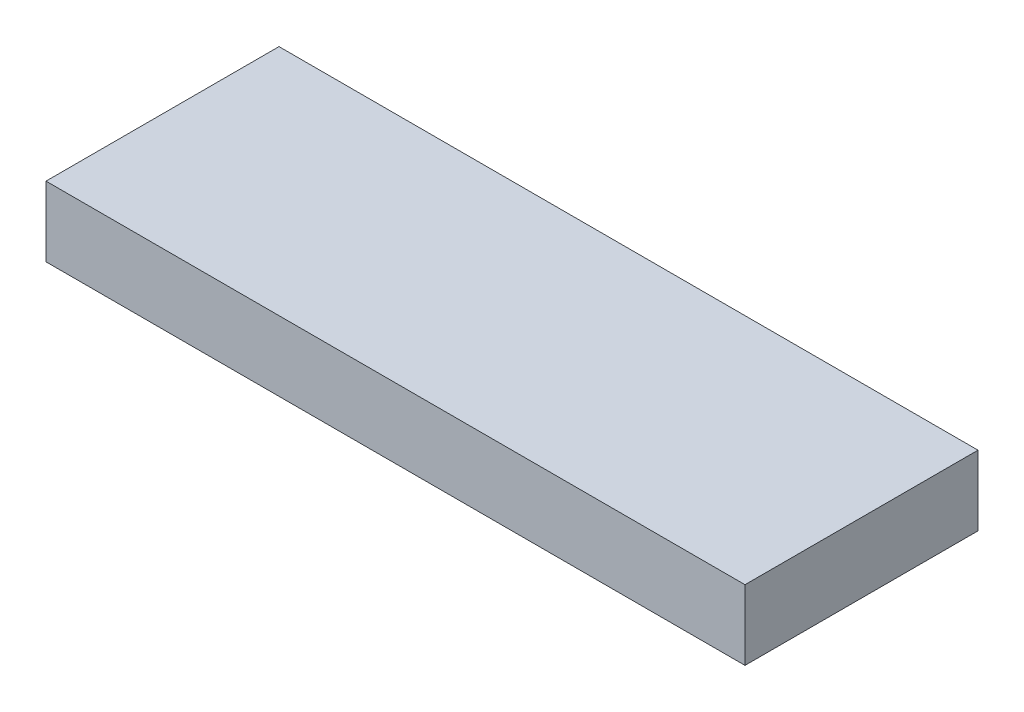
ISO-10303-21;
HEADER;
FILE_DESCRIPTION(('STEP AP214'),'2;1');
FILE_NAME('part.step','',(''),(''),'','','');
FILE_SCHEMA(('AUTOMOTIVE_DESIGN { 1 0 10303 214 1 1 1 1 }'));
ENDSEC;
DATA;
#1=APPLICATION_CONTEXT('core data for automotive mechanical design processes');
#2=APPLICATION_PROTOCOL_DEFINITION('international standard','automotive_design',2000,#1);
#3=PRODUCT_CONTEXT('',#1,'mechanical');
#4=PRODUCT('Part','Part','',(#3));
#5=PRODUCT_RELATED_PRODUCT_CATEGORY('part','',(#4));
#6=PRODUCT_DEFINITION_FORMATION('','',#4);
#7=PRODUCT_DEFINITION_CONTEXT('part definition',#1,'design');
#8=PRODUCT_DEFINITION('design','',#6,#7);
#9=PRODUCT_DEFINITION_SHAPE('','',#8);
#10=(LENGTH_UNIT() NAMED_UNIT(*) SI_UNIT(.MILLI.,.METRE.));
#11=(NAMED_UNIT(*) PLANE_ANGLE_UNIT() SI_UNIT($,.RADIAN.));
#12=(NAMED_UNIT(*) SI_UNIT($,.STERADIAN.) SOLID_ANGLE_UNIT());
#13=UNCERTAINTY_MEASURE_WITH_UNIT(LENGTH_MEASURE(1.E-05),#10,'distance_accuracy_value','');
#14=(GEOMETRIC_REPRESENTATION_CONTEXT(3) GLOBAL_UNCERTAINTY_ASSIGNED_CONTEXT((#13)) GLOBAL_UNIT_ASSIGNED_CONTEXT((#10,
#11,#12)) REPRESENTATION_CONTEXT('',''));
#15=CARTESIAN_POINT('',(0.,0.,0.));
#16=DIRECTION('',(0.,0.,1.));
#17=DIRECTION('',(1.,0.,0.));
#18=AXIS2_PLACEMENT_3D('',#15,#16,#17);
#19=CARTESIAN_POINT('',(300.,46.99,13.));
#20=DIRECTION('',(0.,0.,-1.));
#21=DIRECTION('',(-1.,0.,0.));
#22=AXIS2_PLACEMENT_3D('',#19,#20,#21);
#23=PLANE('',#22);
#24=DIRECTION('',(0.,-1.,0.));
#25=VECTOR('',#24,1.);
#26=CARTESIAN_POINT('',(300.,1.71683972880179E-13,13.));
#27=LINE('',#26,#25);
#28=CARTESIAN_POINT('',(300.,50.,13.));
#29=VERTEX_POINT('',#28);
#30=CARTESIAN_POINT('',(300.,47.,13.));
#31=VERTEX_POINT('',#30);
#32=EDGE_CURVE('E81',#29,#31,#27,.T.);
#33=ORIENTED_EDGE('',*,*,#32,.T.);
#34=DIRECTION('',(-1.,0.,0.));
#35=VECTOR('',#34,1.);
#36=CARTESIAN_POINT('',(300.,47.,13.));
#37=LINE('',#36,#35);
#38=CARTESIAN_POINT('',(270.,47.,13.));
#39=VERTEX_POINT('',#38);
#40=EDGE_CURVE('E85',#31,#39,#37,.T.);
#41=ORIENTED_EDGE('',*,*,#40,.T.);
#42=DIRECTION('',(0.,1.,0.));
#43=VECTOR('',#42,1.);
#44=CARTESIAN_POINT('',(270.,46.99,13.));
#45=LINE('',#44,#43);
#46=CARTESIAN_POINT('',(270.,50.,13.));
#47=VERTEX_POINT('',#46);
#48=EDGE_CURVE('E44',#39,#47,#45,.T.);
#49=ORIENTED_EDGE('',*,*,#48,.T.);
#50=DIRECTION('',(1.,0.,0.));
#51=VECTOR('',#50,1.);
#52=CARTESIAN_POINT('',(-300.,50.,13.));
#53=LINE('',#52,#51);
#54=EDGE_CURVE('E99',#47,#29,#53,.T.);
#55=ORIENTED_EDGE('',*,*,#54,.T.);
#56=EDGE_LOOP('',(#33,#41,#49,#55));
#57=FACE_BOUND('',#56,.T.);
#58=ADVANCED_FACE('F35',(#57),#23,.T.);
#59=CARTESIAN_POINT('',(300.,46.99,23.));
#60=DIRECTION('',(0.,0.,1.));
#61=DIRECTION('',(1.,0.,0.));
#62=AXIS2_PLACEMENT_3D('',#59,#60,#61);
#63=PLANE('',#62);
#64=DIRECTION('',(0.,1.,0.));
#65=VECTOR('',#64,1.);
#66=CARTESIAN_POINT('',(270.,46.99,23.));
#67=LINE('',#66,#65);
#68=CARTESIAN_POINT('',(270.,47.,23.));
#69=VERTEX_POINT('',#68);
#70=CARTESIAN_POINT('',(270.,50.,23.));
#71=VERTEX_POINT('',#70);
#72=EDGE_CURVE('E11',#69,#71,#67,.T.);
#73=ORIENTED_EDGE('',*,*,#72,.F.);
#74=DIRECTION('',(1.,0.,0.));
#75=VECTOR('',#74,1.);
#76=CARTESIAN_POINT('',(300.,47.,23.));
#77=LINE('',#76,#75);
#78=CARTESIAN_POINT('',(300.,47.,23.));
#79=VERTEX_POINT('',#78);
#80=EDGE_CURVE('E96',#69,#79,#77,.T.);
#81=ORIENTED_EDGE('',*,*,#80,.T.);
#82=DIRECTION('',(0.,1.,0.));
#83=VECTOR('',#82,1.);
#84=CARTESIAN_POINT('',(300.,1.71683972880179E-13,23.));
#85=LINE('',#84,#83);
#86=CARTESIAN_POINT('',(300.,50.,23.));
#87=VERTEX_POINT('',#86);
#88=EDGE_CURVE('E39',#79,#87,#85,.T.);
#89=ORIENTED_EDGE('',*,*,#88,.T.);
#90=DIRECTION('',(-1.,0.,0.));
#91=VECTOR('',#90,1.);
#92=CARTESIAN_POINT('',(-300.,50.,23.));
#93=LINE('',#92,#91);
#94=EDGE_CURVE('E88',#87,#71,#93,.T.);
#95=ORIENTED_EDGE('',*,*,#94,.T.);
#96=EDGE_LOOP('',(#73,#81,#89,#95));
#97=FACE_BOUND('',#96,.T.);
#98=ADVANCED_FACE('F94',(#97),#63,.T.);
#99=CARTESIAN_POINT('',(270.,46.99,13.));
#100=DIRECTION('',(-1.,0.,0.));
#101=DIRECTION('',(0.,0.,1.));
#102=AXIS2_PLACEMENT_3D('',#99,#100,#101);
#103=PLANE('',#102);
#104=ORIENTED_EDGE('',*,*,#48,.F.);
#105=DIRECTION('',(0.,0.,1.));
#106=VECTOR('',#105,1.);
#107=CARTESIAN_POINT('',(270.,47.,3.));
#108=LINE('',#107,#106);
#109=EDGE_CURVE('E102',#39,#69,#108,.T.);
#110=ORIENTED_EDGE('',*,*,#109,.T.);
#111=ORIENTED_EDGE('',*,*,#72,.T.);
#112=DIRECTION('',(0.,0.,-1.));
#113=VECTOR('',#112,1.);
#114=CARTESIAN_POINT('',(270.,50.,60.));
#115=LINE('',#114,#113);
#116=EDGE_CURVE('E90',#71,#47,#115,.T.);
#117=ORIENTED_EDGE('',*,*,#116,.T.);
#118=EDGE_LOOP('',(#104,#110,#111,#117));
#119=FACE_BOUND('',#118,.T.);
#120=ADVANCED_FACE('F111',(#119),#103,.T.);
#121=CARTESIAN_POINT('',(300.,1.71683972880179E-13,0.));
#122=DIRECTION('',(-1.,0.,0.));
#123=DIRECTION('',(0.,-1.,0.));
#124=AXIS2_PLACEMENT_3D('',#121,#122,#123);
#125=PLANE('',#124);
#126=ORIENTED_EDGE('',*,*,#32,.F.);
#127=DIRECTION('',(0.,0.,-1.));
#128=VECTOR('',#127,1.);
#129=CARTESIAN_POINT('',(300.,50.,60.));
#130=LINE('',#129,#128);
#131=EDGE_CURVE('E76',#87,#29,#130,.T.);
#132=ORIENTED_EDGE('',*,*,#131,.F.);
#133=ORIENTED_EDGE('',*,*,#88,.F.);
#134=DIRECTION('',(0.,0.,1.));
#135=VECTOR('',#134,1.);
#136=CARTESIAN_POINT('',(300.,47.,3.));
#137=LINE('',#136,#135);
#138=EDGE_CURVE('E84',#31,#79,#137,.T.);
#139=ORIENTED_EDGE('',*,*,#138,.F.);
#140=EDGE_LOOP('',(#126,#132,#133,#139));
#141=FACE_BOUND('',#140,.T.);
#142=ADVANCED_FACE('F78',(#141),#125,.F.);
#143=CARTESIAN_POINT('',(-300.,50.,60.));
#144=DIRECTION('',(0.,-1.,0.));
#145=DIRECTION('',(0.,0.,-1.));
#146=AXIS2_PLACEMENT_3D('',#143,#144,#145);
#147=PLANE('',#146);
#148=ORIENTED_EDGE('',*,*,#54,.F.);
#149=ORIENTED_EDGE('',*,*,#116,.F.);
#150=ORIENTED_EDGE('',*,*,#94,.F.);
#151=ORIENTED_EDGE('',*,*,#131,.T.);
#152=EDGE_LOOP('',(#148,#149,#150,#151));
#153=FACE_BOUND('',#152,.T.);
#154=ADVANCED_FACE('F89',(#153),#147,.F.);
#155=CARTESIAN_POINT('',(300.,47.,3.));
#156=DIRECTION('',(0.,1.,0.));
#157=DIRECTION('',(0.,0.,1.));
#158=AXIS2_PLACEMENT_3D('',#155,#156,#157);
#159=PLANE('',#158);
#160=ORIENTED_EDGE('',*,*,#40,.F.);
#161=ORIENTED_EDGE('',*,*,#138,.T.);
#162=ORIENTED_EDGE('',*,*,#80,.F.);
#163=ORIENTED_EDGE('',*,*,#109,.F.);
#164=EDGE_LOOP('',(#160,#161,#162,#163));
#165=FACE_BOUND('',#164,.T.);
#166=ADVANCED_FACE('F37',(#165),#159,.F.);
#167=CLOSED_SHELL('',(#58,#98,#120,#142,#154,#166));
#168=MANIFOLD_SOLID_BREP('B2',#167);
#169=ADVANCED_BREP_SHAPE_REPRESENTATION('',(#18,#168),#14);
#170=SHAPE_DEFINITION_REPRESENTATION(#9,#169);
ENDSEC;
END-ISO-10303-21;
